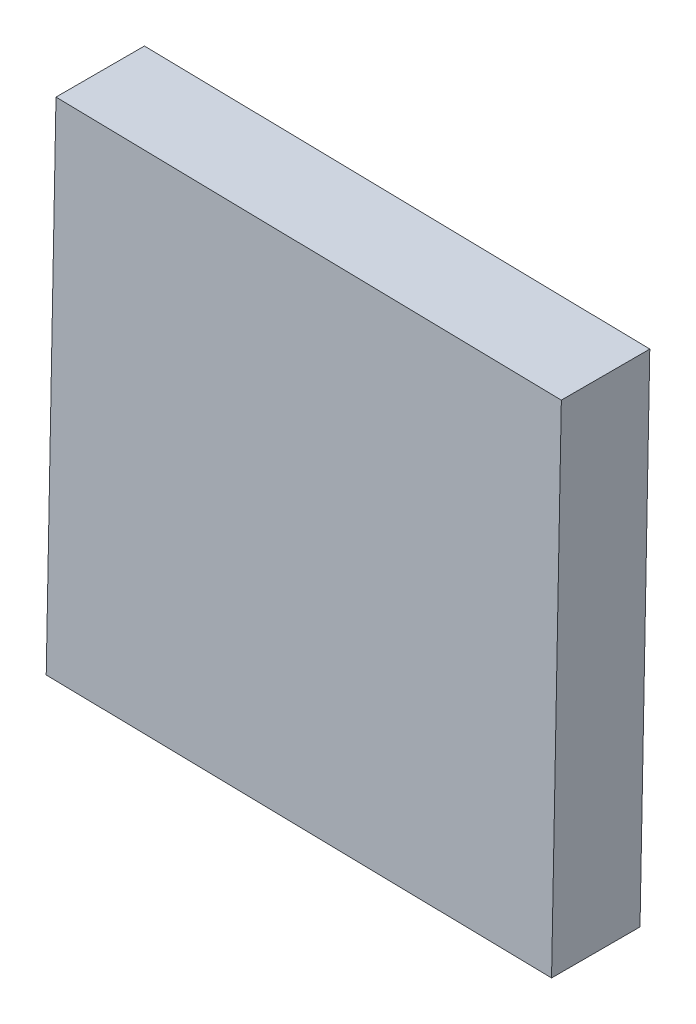
ISO-10303-21;
HEADER;
FILE_DESCRIPTION(('STEP AP214'),'2;1');
FILE_NAME('part.step','',(''),(''),'','','');
FILE_SCHEMA(('AUTOMOTIVE_DESIGN { 1 0 10303 214 1 1 1 1 }'));
ENDSEC;
DATA;
#1=APPLICATION_CONTEXT('core data for automotive mechanical design processes');
#2=APPLICATION_PROTOCOL_DEFINITION('international standard','automotive_design',2000,#1);
#3=PRODUCT_CONTEXT('',#1,'mechanical');
#4=PRODUCT('Part','Part','',(#3));
#5=PRODUCT_RELATED_PRODUCT_CATEGORY('part','',(#4));
#6=PRODUCT_DEFINITION_FORMATION('','',#4);
#7=PRODUCT_DEFINITION_CONTEXT('part definition',#1,'design');
#8=PRODUCT_DEFINITION('design','',#6,#7);
#9=PRODUCT_DEFINITION_SHAPE('','',#8);
#10=(LENGTH_UNIT() NAMED_UNIT(*) SI_UNIT(.MILLI.,.METRE.));
#11=(NAMED_UNIT(*) PLANE_ANGLE_UNIT() SI_UNIT($,.RADIAN.));
#12=(NAMED_UNIT(*) SI_UNIT($,.STERADIAN.) SOLID_ANGLE_UNIT());
#13=UNCERTAINTY_MEASURE_WITH_UNIT(LENGTH_MEASURE(1.E-05),#10,'distance_accuracy_value','');
#14=(GEOMETRIC_REPRESENTATION_CONTEXT(3) GLOBAL_UNCERTAINTY_ASSIGNED_CONTEXT((#13)) GLOBAL_UNIT_ASSIGNED_CONTEXT((#10,
#11,#12)) REPRESENTATION_CONTEXT('',''));
#15=CARTESIAN_POINT('',(0.,0.,0.));
#16=DIRECTION('',(0.,0.,1.));
#17=DIRECTION('',(1.,0.,0.));
#18=AXIS2_PLACEMENT_3D('',#15,#16,#17);
#19=CARTESIAN_POINT('',(-1.71244910615213,0.776448251307159,41.1510965279299));
#20=DIRECTION('',(0.,0.,1.));
#21=DIRECTION('',(0.999812677663925,-0.0193548335692301,0.));
#22=AXIS2_PLACEMENT_3D('',#19,#20,#21);
#23=PLANE('',#22);
#24=DIRECTION('',(0.0193548335692301,0.999812677663925,0.));
#25=VECTOR('',#24,1.);
#26=CARTESIAN_POINT('',(-4.30113458468434,-1.71391467269336,41.1510965279298));
#27=LINE('',#26,#25);
#28=CARTESIAN_POINT('',(-4.30113458468434,-1.71391467269336,41.1510965279298));
#29=VERTEX_POINT('',#28);
#30=CARTESIAN_POINT('',(-4.20281203015266,3.36513372983937,41.1510965279297));
#31=VERTEX_POINT('',#30);
#32=EDGE_CURVE('E72',#29,#31,#27,.T.);
#33=ORIENTED_EDGE('',*,*,#32,.T.);
#34=DIRECTION('',(0.999812677663925,-0.0193548335692299,0.));
#35=VECTOR('',#34,1.);
#36=CARTESIAN_POINT('',(-4.20281203015266,3.36513372983937,41.1510965279297));
#37=LINE('',#36,#35);
#38=CARTESIAN_POINT('',(0.876236372380084,3.26681117530768,41.1510965279299));
#39=VERTEX_POINT('',#38);
#40=EDGE_CURVE('E35',#31,#39,#37,.T.);
#41=ORIENTED_EDGE('',*,*,#40,.T.);
#42=DIRECTION('',(-0.0193548335692301,-0.999812677663925,0.));
#43=VECTOR('',#42,1.);
#44=CARTESIAN_POINT('',(0.777913817848395,-1.81223722722505,41.15109652793));
#45=LINE('',#44,#43);
#46=CARTESIAN_POINT('',(0.777913817848395,-1.81223722722505,41.15109652793));
#47=VERTEX_POINT('',#46);
#48=EDGE_CURVE('E95',#39,#47,#45,.T.);
#49=ORIENTED_EDGE('',*,*,#48,.T.);
#50=DIRECTION('',(-0.999812677663925,0.0193548335692299,0.));
#51=VECTOR('',#50,1.);
#52=CARTESIAN_POINT('',(-4.30113458468434,-1.71391467269336,41.1510965279298));
#53=LINE('',#52,#51);
#54=EDGE_CURVE('E70',#47,#29,#53,.T.);
#55=ORIENTED_EDGE('',*,*,#54,.T.);
#56=EDGE_LOOP('',(#33,#41,#49,#55));
#57=FACE_BOUND('',#56,.T.);
#58=ADVANCED_FACE('F32',(#57),#23,.F.);
#59=CARTESIAN_POINT('',(-4.20281203015269,3.36513372983939,42.0400965279297));
#60=DIRECTION('',(-0.0193548335692299,-0.999812677663925,0.));
#61=DIRECTION('',(0.999812677663925,-0.0193548335692299,0.));
#62=AXIS2_PLACEMENT_3D('',#59,#60,#61);
#63=PLANE('',#62);
#64=DIRECTION('',(0.,0.,1.));
#65=VECTOR('',#64,1.);
#66=CARTESIAN_POINT('',(0.876236372380056,3.2668111753077,42.0400965279299));
#67=LINE('',#66,#65);
#68=CARTESIAN_POINT('',(0.876236372380056,3.2668111753077,42.0400965279299));
#69=VERTEX_POINT('',#68);
#70=EDGE_CURVE('E83',#69,#39,#67,.F.);
#71=ORIENTED_EDGE('',*,*,#70,.T.);
#72=ORIENTED_EDGE('',*,*,#40,.F.);
#73=DIRECTION('',(0.,0.,1.));
#74=VECTOR('',#73,1.);
#75=CARTESIAN_POINT('',(-4.20281203015269,3.36513372983939,42.0400965279297));
#76=LINE('',#75,#74);
#77=CARTESIAN_POINT('',(-4.20281203015269,3.36513372983939,42.0400965279297));
#78=VERTEX_POINT('',#77);
#79=EDGE_CURVE('E78',#31,#78,#76,.T.);
#80=ORIENTED_EDGE('',*,*,#79,.T.);
#81=DIRECTION('',(0.999812677663925,-0.0193548335692301,0.));
#82=VECTOR('',#81,1.);
#83=CARTESIAN_POINT('',(-1.66328782888631,3.31597245257354,42.0400965279299));
#84=LINE('',#83,#82);
#85=EDGE_CURVE('E98',#69,#78,#84,.F.);
#86=ORIENTED_EDGE('',*,*,#85,.F.);
#87=EDGE_LOOP('',(#71,#72,#80,#86));
#88=FACE_BOUND('',#87,.T.);
#89=ADVANCED_FACE('F80',(#88),#63,.F.);
#90=CARTESIAN_POINT('',(-4.30113458468437,-1.71391467269335,42.0400965279298));
#91=DIRECTION('',(0.999812677663925,-0.0193548335692301,0.));
#92=DIRECTION('',(0.0193548335692301,0.999812677663925,0.));
#93=AXIS2_PLACEMENT_3D('',#90,#91,#92);
#94=PLANE('',#93);
#95=ORIENTED_EDGE('',*,*,#79,.F.);
#96=ORIENTED_EDGE('',*,*,#32,.F.);
#97=DIRECTION('',(0.,0.,1.));
#98=VECTOR('',#97,1.);
#99=CARTESIAN_POINT('',(-4.30113458468437,-1.71391467269335,42.0400965279298));
#100=LINE('',#99,#98);
#101=CARTESIAN_POINT('',(-4.30113458468437,-1.71391467269335,42.0400965279298));
#102=VERTEX_POINT('',#101);
#103=EDGE_CURVE('E90',#29,#102,#100,.T.);
#104=ORIENTED_EDGE('',*,*,#103,.T.);
#105=DIRECTION('',(0.0193548335692301,0.999812677663925,0.));
#106=VECTOR('',#105,1.);
#107=CARTESIAN_POINT('',(-4.25197330741853,0.825609528573017,42.0400965279298));
#108=LINE('',#107,#106);
#109=EDGE_CURVE('E87',#78,#102,#108,.F.);
#110=ORIENTED_EDGE('',*,*,#109,.F.);
#111=EDGE_LOOP('',(#95,#96,#104,#110));
#112=FACE_BOUND('',#111,.T.);
#113=ADVANCED_FACE('F85',(#112),#94,.F.);
#114=CARTESIAN_POINT('',(-4.30113458468437,-1.71391467269335,42.0400965279298));
#115=DIRECTION('',(0.0193548335692299,0.999812677663925,0.));
#116=DIRECTION('',(-0.999812677663925,0.0193548335692299,0.));
#117=AXIS2_PLACEMENT_3D('',#114,#115,#116);
#118=PLANE('',#117);
#119=ORIENTED_EDGE('',*,*,#103,.F.);
#120=ORIENTED_EDGE('',*,*,#54,.F.);
#121=DIRECTION('',(0.,0.,1.));
#122=VECTOR('',#121,1.);
#123=CARTESIAN_POINT('',(0.777913817848367,-1.81223722722504,42.04009652793));
#124=LINE('',#123,#122);
#125=CARTESIAN_POINT('',(0.777913817848367,-1.81223722722504,42.04009652793));
#126=VERTEX_POINT('',#125);
#127=EDGE_CURVE('E50',#47,#126,#124,.T.);
#128=ORIENTED_EDGE('',*,*,#127,.T.);
#129=DIRECTION('',(0.999812677663925,-0.0193548335692301,0.));
#130=VECTOR('',#129,1.);
#131=CARTESIAN_POINT('',(-1.76161038341801,-1.76307594995919,42.0400965279299));
#132=LINE('',#131,#130);
#133=EDGE_CURVE('E41',#102,#126,#132,.T.);
#134=ORIENTED_EDGE('',*,*,#133,.F.);
#135=EDGE_LOOP('',(#119,#120,#128,#134));
#136=FACE_BOUND('',#135,.T.);
#137=ADVANCED_FACE('F104',(#136),#118,.F.);
#138=CARTESIAN_POINT('',(0.777913817848367,-1.81223722722504,42.04009652793));
#139=DIRECTION('',(-0.999812677663925,0.0193548335692301,0.));
#140=DIRECTION('',(-0.0193548335692301,-0.999812677663925,0.));
#141=AXIS2_PLACEMENT_3D('',#138,#139,#140);
#142=PLANE('',#141);
#143=ORIENTED_EDGE('',*,*,#127,.F.);
#144=ORIENTED_EDGE('',*,*,#48,.F.);
#145=ORIENTED_EDGE('',*,*,#70,.F.);
#146=DIRECTION('',(0.0193548335692301,0.999812677663925,0.));
#147=VECTOR('',#146,1.);
#148=CARTESIAN_POINT('',(0.827075095114211,0.727286974041328,42.0400965279299));
#149=LINE('',#148,#147);
#150=EDGE_CURVE('E11',#126,#69,#149,.T.);
#151=ORIENTED_EDGE('',*,*,#150,.F.);
#152=EDGE_LOOP('',(#143,#144,#145,#151));
#153=FACE_BOUND('',#152,.T.);
#154=ADVANCED_FACE('F106',(#153),#142,.F.);
#155=CARTESIAN_POINT('',(-1.71244910615216,0.776448251307172,42.0400965279299));
#156=DIRECTION('',(0.,0.,1.));
#157=DIRECTION('',(0.999812677663925,-0.0193548335692301,0.));
#158=AXIS2_PLACEMENT_3D('',#155,#156,#157);
#159=PLANE('',#158);
#160=ORIENTED_EDGE('',*,*,#133,.T.);
#161=ORIENTED_EDGE('',*,*,#150,.T.);
#162=ORIENTED_EDGE('',*,*,#85,.T.);
#163=ORIENTED_EDGE('',*,*,#109,.T.);
#164=EDGE_LOOP('',(#160,#161,#162,#163));
#165=FACE_BOUND('',#164,.T.);
#166=ADVANCED_FACE('F103',(#165),#159,.T.);
#167=CLOSED_SHELL('',(#58,#89,#113,#137,#154,#166));
#168=MANIFOLD_SOLID_BREP('B2',#167);
#169=ADVANCED_BREP_SHAPE_REPRESENTATION('',(#18,#168),#14);
#170=SHAPE_DEFINITION_REPRESENTATION(#9,#169);
ENDSEC;
END-ISO-10303-21;
